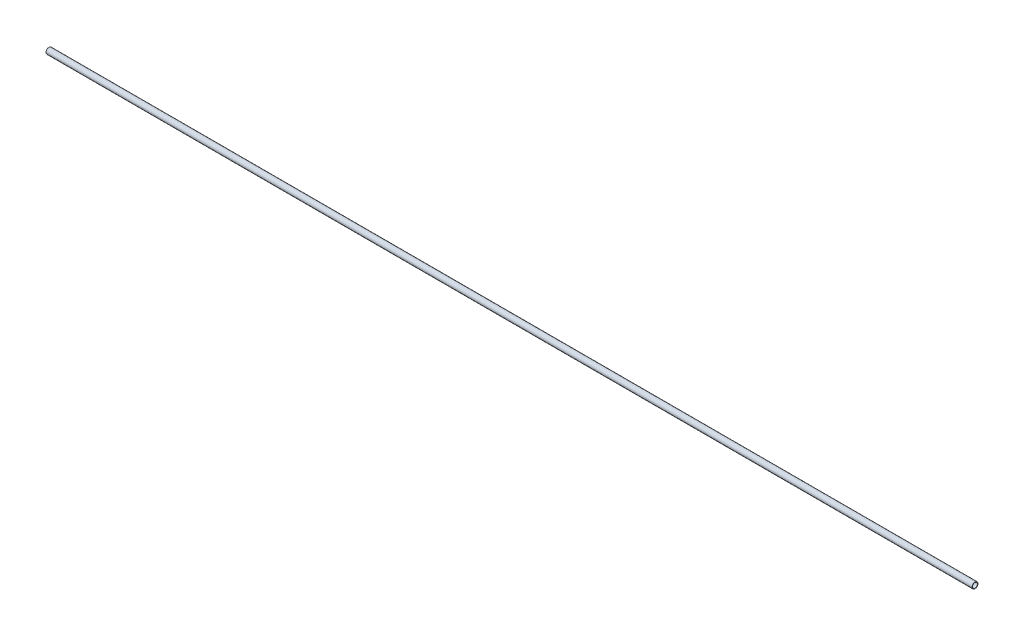
ISO-10303-21;
HEADER;
FILE_DESCRIPTION(('STEP AP214'),'2;1');
FILE_NAME('part.step','',(''),(''),'','','');
FILE_SCHEMA(('AUTOMOTIVE_DESIGN { 1 0 10303 214 1 1 1 1 }'));
ENDSEC;
DATA;
#1=APPLICATION_CONTEXT('core data for automotive mechanical design processes');
#2=APPLICATION_PROTOCOL_DEFINITION('international standard','automotive_design',2000,#1);
#3=PRODUCT_CONTEXT('',#1,'mechanical');
#4=PRODUCT('Part','Part','',(#3));
#5=PRODUCT_RELATED_PRODUCT_CATEGORY('part','',(#4));
#6=PRODUCT_DEFINITION_FORMATION('','',#4);
#7=PRODUCT_DEFINITION_CONTEXT('part definition',#1,'design');
#8=PRODUCT_DEFINITION('design','',#6,#7);
#9=PRODUCT_DEFINITION_SHAPE('','',#8);
#10=(LENGTH_UNIT() NAMED_UNIT(*) SI_UNIT(.MILLI.,.METRE.));
#11=(NAMED_UNIT(*) PLANE_ANGLE_UNIT() SI_UNIT($,.RADIAN.));
#12=(NAMED_UNIT(*) SI_UNIT($,.STERADIAN.) SOLID_ANGLE_UNIT());
#13=UNCERTAINTY_MEASURE_WITH_UNIT(LENGTH_MEASURE(1.E-05),#10,'distance_accuracy_value','');
#14=(GEOMETRIC_REPRESENTATION_CONTEXT(3) GLOBAL_UNCERTAINTY_ASSIGNED_CONTEXT((#13)) GLOBAL_UNIT_ASSIGNED_CONTEXT((#10,
#11,#12)) REPRESENTATION_CONTEXT('',''));
#15=CARTESIAN_POINT('',(0.,0.,0.));
#16=DIRECTION('',(0.,0.,1.));
#17=DIRECTION('',(1.,0.,0.));
#18=AXIS2_PLACEMENT_3D('',#15,#16,#17);
#19=CARTESIAN_POINT('',(0.,0.,0.));
#20=DIRECTION('',(1.,0.,0.));
#21=DIRECTION('',(0.,0.,-1.));
#22=AXIS2_PLACEMENT_3D('',#19,#20,#21);
#23=CYLINDRICAL_SURFACE('',#22,13.1);
#24=CARTESIAN_POINT('',(0.,0.,0.));
#25=DIRECTION('',(1.,0.,0.));
#26=DIRECTION('',(0.,0.,-1.));
#27=AXIS2_PLACEMENT_3D('',#24,#25,#26);
#28=CIRCLE('',#27,13.1);
#29=CARTESIAN_POINT('',(0.,0.,-13.1));
#30=VERTEX_POINT('',#29);
#31=EDGE_CURVE('E16',#30,#30,#28,.T.);
#32=ORIENTED_EDGE('',*,*,#31,.F.);
#33=EDGE_LOOP('',(#32));
#34=FACE_BOUND('',#33,.T.);
#35=CARTESIAN_POINT('',(5000.,0.,0.));
#36=DIRECTION('',(1.,0.,0.));
#37=DIRECTION('',(0.,0.,-1.));
#38=AXIS2_PLACEMENT_3D('',#35,#36,#37);
#39=CIRCLE('',#38,13.1);
#40=CARTESIAN_POINT('',(5000.,0.,-13.1));
#41=VERTEX_POINT('',#40);
#42=EDGE_CURVE('E25',#41,#41,#39,.F.);
#43=ORIENTED_EDGE('',*,*,#42,.F.);
#44=EDGE_LOOP('',(#43));
#45=FACE_BOUND('',#44,.T.);
#46=ADVANCED_FACE('F13',(#34,#45),#23,.F.);
#47=CARTESIAN_POINT('',(0.,-16.192002108351,-16.));
#48=DIRECTION('',(-1.,0.,0.));
#49=DIRECTION('',(0.,0.,1.));
#50=AXIS2_PLACEMENT_3D('',#47,#48,#49);
#51=PLANE('',#50);
#52=ORIENTED_EDGE('',*,*,#31,.T.);
#53=EDGE_LOOP('',(#52));
#54=FACE_BOUND('',#53,.T.);
#55=CARTESIAN_POINT('',(0.,0.,0.));
#56=DIRECTION('',(1.,0.,0.));
#57=DIRECTION('',(0.,0.,-1.));
#58=AXIS2_PLACEMENT_3D('',#55,#56,#57);
#59=CIRCLE('',#58,16.);
#60=CARTESIAN_POINT('',(0.,0.,-16.));
#61=VERTEX_POINT('',#60);
#62=EDGE_CURVE('E20',#61,#61,#59,.T.);
#63=ORIENTED_EDGE('',*,*,#62,.F.);
#64=EDGE_LOOP('',(#63));
#65=FACE_BOUND('',#64,.T.);
#66=ADVANCED_FACE('F33',(#54,#65),#51,.T.);
#67=CARTESIAN_POINT('',(5000.,-16.192002108351,16.));
#68=DIRECTION('',(1.,0.,0.));
#69=DIRECTION('',(0.,0.,-1.));
#70=AXIS2_PLACEMENT_3D('',#67,#68,#69);
#71=PLANE('',#70);
#72=ORIENTED_EDGE('',*,*,#42,.T.);
#73=EDGE_LOOP('',(#72));
#74=FACE_BOUND('',#73,.T.);
#75=CARTESIAN_POINT('',(5000.,0.,0.));
#76=DIRECTION('',(1.,0.,0.));
#77=DIRECTION('',(0.,0.,-1.));
#78=AXIS2_PLACEMENT_3D('',#75,#76,#77);
#79=CIRCLE('',#78,16.);
#80=CARTESIAN_POINT('',(5000.,0.,-16.));
#81=VERTEX_POINT('',#80);
#82=EDGE_CURVE('E8',#81,#81,#79,.F.);
#83=ORIENTED_EDGE('',*,*,#82,.F.);
#84=EDGE_LOOP('',(#83));
#85=FACE_BOUND('',#84,.T.);
#86=ADVANCED_FACE('F42',(#74,#85),#71,.T.);
#87=CARTESIAN_POINT('',(5000.,0.,0.));
#88=DIRECTION('',(1.,0.,0.));
#89=DIRECTION('',(0.,0.,-1.));
#90=AXIS2_PLACEMENT_3D('',#87,#88,#89);
#91=CYLINDRICAL_SURFACE('',#90,16.);
#92=ORIENTED_EDGE('',*,*,#62,.T.);
#93=EDGE_LOOP('',(#92));
#94=FACE_BOUND('',#93,.T.);
#95=ORIENTED_EDGE('',*,*,#82,.T.);
#96=EDGE_LOOP('',(#95));
#97=FACE_BOUND('',#96,.T.);
#98=ADVANCED_FACE('F43',(#94,#97),#91,.T.);
#99=CLOSED_SHELL('',(#46,#66,#86,#98));
#100=MANIFOLD_SOLID_BREP('B1',#99);
#101=ADVANCED_BREP_SHAPE_REPRESENTATION('',(#18,#100),#14);
#102=SHAPE_DEFINITION_REPRESENTATION(#9,#101);
ENDSEC;
END-ISO-10303-21;
